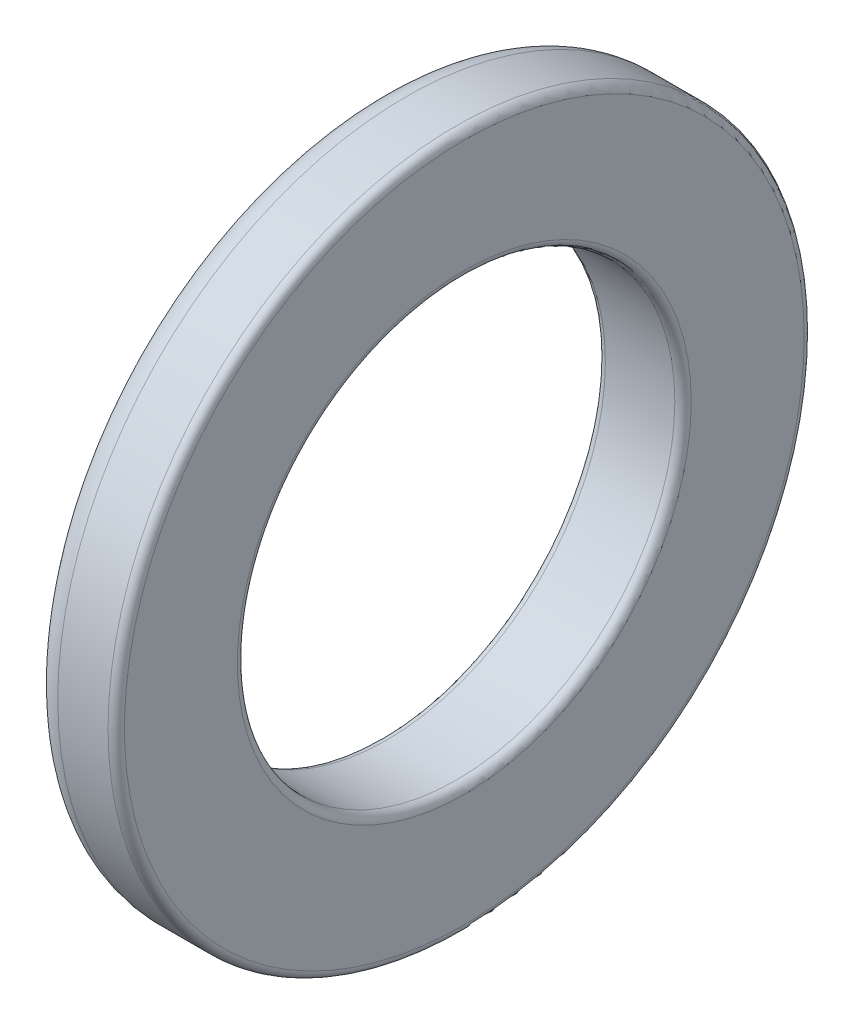
ISO-10303-21;
HEADER;
FILE_DESCRIPTION(('STEP AP214'),'2;1');
FILE_NAME('part.step','',(''),(''),'','','');
FILE_SCHEMA(('AUTOMOTIVE_DESIGN { 1 0 10303 214 1 1 1 1 }'));
ENDSEC;
DATA;
#1=APPLICATION_CONTEXT('core data for automotive mechanical design processes');
#2=APPLICATION_PROTOCOL_DEFINITION('international standard','automotive_design',2000,#1);
#3=PRODUCT_CONTEXT('',#1,'mechanical');
#4=PRODUCT('Part','Part','',(#3));
#5=PRODUCT_RELATED_PRODUCT_CATEGORY('part','',(#4));
#6=PRODUCT_DEFINITION_FORMATION('','',#4);
#7=PRODUCT_DEFINITION_CONTEXT('part definition',#1,'design');
#8=PRODUCT_DEFINITION('design','',#6,#7);
#9=PRODUCT_DEFINITION_SHAPE('','',#8);
#10=(LENGTH_UNIT() NAMED_UNIT(*) SI_UNIT(.MILLI.,.METRE.));
#11=(NAMED_UNIT(*) PLANE_ANGLE_UNIT() SI_UNIT($,.RADIAN.));
#12=(NAMED_UNIT(*) SI_UNIT($,.STERADIAN.) SOLID_ANGLE_UNIT());
#13=UNCERTAINTY_MEASURE_WITH_UNIT(LENGTH_MEASURE(1.E-05),#10,'distance_accuracy_value','');
#14=(GEOMETRIC_REPRESENTATION_CONTEXT(3) GLOBAL_UNCERTAINTY_ASSIGNED_CONTEXT((#13)) GLOBAL_UNIT_ASSIGNED_CONTEXT((#10,
#11,#12)) REPRESENTATION_CONTEXT('',''));
#15=CARTESIAN_POINT('',(0.,0.,0.));
#16=DIRECTION('',(0.,0.,1.));
#17=DIRECTION('',(1.,0.,0.));
#18=AXIS2_PLACEMENT_3D('',#15,#16,#17);
#19=CARTESIAN_POINT('',(1.57,0.,0.));
#20=DIRECTION('',(1.,0.,0.));
#21=DIRECTION('',(0.,0.,-1.));
#22=AXIS2_PLACEMENT_3D('',#19,#20,#21);
#23=PLANE('',#22);
#24=CARTESIAN_POINT('',(1.57,0.,0.));
#25=DIRECTION('',(1.,0.,0.));
#26=DIRECTION('',(0.,0.,-1.));
#27=AXIS2_PLACEMENT_3D('',#24,#25,#26);
#28=CIRCLE('',#27,4.15);
#29=CARTESIAN_POINT('',(1.57,0.,-4.15));
#30=VERTEX_POINT('',#29);
#31=EDGE_CURVE('E54',#30,#30,#28,.F.);
#32=ORIENTED_EDGE('',*,*,#31,.T.);
#33=EDGE_LOOP('',(#32));
#34=FACE_BOUND('',#33,.T.);
#35=CARTESIAN_POINT('',(1.57,0.,0.));
#36=DIRECTION('',(1.,0.,0.));
#37=DIRECTION('',(0.,0.,-1.));
#38=AXIS2_PLACEMENT_3D('',#35,#36,#37);
#39=CIRCLE('',#38,6.215);
#40=CARTESIAN_POINT('',(1.57,0.,-6.215));
#41=VERTEX_POINT('',#40);
#42=EDGE_CURVE('E57',#41,#41,#39,.T.);
#43=ORIENTED_EDGE('',*,*,#42,.T.);
#44=EDGE_LOOP('',(#43));
#45=FACE_BOUND('',#44,.T.);
#46=ADVANCED_FACE('F31',(#34,#45),#23,.T.);
#47=CARTESIAN_POINT('',(0.,0.,0.));
#48=DIRECTION('',(1.,0.,0.));
#49=DIRECTION('',(0.,0.,-1.));
#50=AXIS2_PLACEMENT_3D('',#47,#48,#49);
#51=PLANE('',#50);
#52=CARTESIAN_POINT('',(0.,0.,0.));
#53=DIRECTION('',(1.,0.,0.));
#54=DIRECTION('',(0.,0.,-1.));
#55=AXIS2_PLACEMENT_3D('',#52,#53,#54);
#56=CIRCLE('',#55,5.865);
#57=CARTESIAN_POINT('',(0.,0.,-5.865));
#58=VERTEX_POINT('',#57);
#59=EDGE_CURVE('E10',#58,#58,#56,.F.);
#60=ORIENTED_EDGE('',*,*,#59,.T.);
#61=EDGE_LOOP('',(#60));
#62=FACE_BOUND('',#61,.T.);
#63=CARTESIAN_POINT('',(0.,0.,0.));
#64=DIRECTION('',(1.,0.,0.));
#65=DIRECTION('',(0.,0.,-1.));
#66=AXIS2_PLACEMENT_3D('',#63,#64,#65);
#67=CIRCLE('',#66,4.15);
#68=CARTESIAN_POINT('',(0.,0.,-4.15));
#69=VERTEX_POINT('',#68);
#70=EDGE_CURVE('E46',#69,#69,#67,.T.);
#71=ORIENTED_EDGE('',*,*,#70,.T.);
#72=EDGE_LOOP('',(#71));
#73=FACE_BOUND('',#72,.T.);
#74=ADVANCED_FACE('F84',(#62,#73),#51,.F.);
#75=CARTESIAN_POINT('',(1.57,0.,0.));
#76=DIRECTION('',(-1.,0.,0.));
#77=DIRECTION('',(0.,0.,1.));
#78=AXIS2_PLACEMENT_3D('',#75,#76,#77);
#79=CYLINDRICAL_SURFACE('',#78,6.365);
#80=CARTESIAN_POINT('',(0.5,0.,0.));
#81=DIRECTION('',(1.,0.,0.));
#82=DIRECTION('',(0.,0.,-1.));
#83=AXIS2_PLACEMENT_3D('',#80,#81,#82);
#84=CIRCLE('',#83,6.365);
#85=CARTESIAN_POINT('',(0.5,0.,-6.365));
#86=VERTEX_POINT('',#85);
#87=EDGE_CURVE('E38',#86,#86,#84,.T.);
#88=ORIENTED_EDGE('',*,*,#87,.T.);
#89=EDGE_LOOP('',(#88));
#90=FACE_BOUND('',#89,.T.);
#91=CARTESIAN_POINT('',(1.42,0.,0.));
#92=DIRECTION('',(1.,0.,0.));
#93=DIRECTION('',(0.,0.,-1.));
#94=AXIS2_PLACEMENT_3D('',#91,#92,#93);
#95=CIRCLE('',#94,6.365);
#96=CARTESIAN_POINT('',(1.42,0.,-6.365));
#97=VERTEX_POINT('',#96);
#98=EDGE_CURVE('E51',#97,#97,#95,.F.);
#99=ORIENTED_EDGE('',*,*,#98,.T.);
#100=EDGE_LOOP('',(#99));
#101=FACE_BOUND('',#100,.T.);
#102=ADVANCED_FACE('F78',(#90,#101),#79,.T.);
#103=CARTESIAN_POINT('',(1.57,0.,0.));
#104=DIRECTION('',(-1.,0.,0.));
#105=DIRECTION('',(0.,0.,1.));
#106=AXIS2_PLACEMENT_3D('',#103,#104,#105);
#107=CYLINDRICAL_SURFACE('',#106,4.);
#108=CARTESIAN_POINT('',(0.15,0.,0.));
#109=DIRECTION('',(1.,0.,0.));
#110=DIRECTION('',(0.,0.,-1.));
#111=AXIS2_PLACEMENT_3D('',#108,#109,#110);
#112=CIRCLE('',#111,4.);
#113=CARTESIAN_POINT('',(0.15,0.,-4.));
#114=VERTEX_POINT('',#113);
#115=EDGE_CURVE('E42',#114,#114,#112,.F.);
#116=ORIENTED_EDGE('',*,*,#115,.T.);
#117=EDGE_LOOP('',(#116));
#118=FACE_BOUND('',#117,.T.);
#119=CARTESIAN_POINT('',(1.42,0.,0.));
#120=DIRECTION('',(1.,0.,0.));
#121=DIRECTION('',(0.,0.,-1.));
#122=AXIS2_PLACEMENT_3D('',#119,#120,#121);
#123=CIRCLE('',#122,4.);
#124=CARTESIAN_POINT('',(1.42,0.,-4.));
#125=VERTEX_POINT('',#124);
#126=EDGE_CURVE('E60',#125,#125,#123,.T.);
#127=ORIENTED_EDGE('',*,*,#126,.T.);
#128=EDGE_LOOP('',(#127));
#129=FACE_BOUND('',#128,.T.);
#130=ADVANCED_FACE('F64',(#118,#129),#107,.F.);
#131=CARTESIAN_POINT('',(1.42,0.,0.));
#132=DIRECTION('',(1.,0.,0.));
#133=DIRECTION('',(0.,0.,-1.));
#134=AXIS2_PLACEMENT_3D('',#131,#132,#133);
#135=TOROIDAL_SURFACE('',#134,4.15,0.15);
#136=ORIENTED_EDGE('',*,*,#31,.F.);
#137=EDGE_LOOP('',(#136));
#138=FACE_BOUND('',#137,.T.);
#139=ORIENTED_EDGE('',*,*,#126,.F.);
#140=EDGE_LOOP('',(#139));
#141=FACE_BOUND('',#140,.T.);
#142=ADVANCED_FACE('F66',(#138,#141),#135,.T.);
#143=CARTESIAN_POINT('',(1.42,0.,0.));
#144=DIRECTION('',(1.,0.,0.));
#145=DIRECTION('',(0.,0.,-1.));
#146=AXIS2_PLACEMENT_3D('',#143,#144,#145);
#147=TOROIDAL_SURFACE('',#146,6.215,0.15);
#148=ORIENTED_EDGE('',*,*,#98,.F.);
#149=EDGE_LOOP('',(#148));
#150=FACE_BOUND('',#149,.T.);
#151=ORIENTED_EDGE('',*,*,#42,.F.);
#152=EDGE_LOOP('',(#151));
#153=FACE_BOUND('',#152,.T.);
#154=ADVANCED_FACE('F68',(#150,#153),#147,.T.);
#155=CARTESIAN_POINT('',(0.15,0.,0.));
#156=DIRECTION('',(1.,0.,0.));
#157=DIRECTION('',(0.,0.,-1.));
#158=AXIS2_PLACEMENT_3D('',#155,#156,#157);
#159=TOROIDAL_SURFACE('',#158,4.15,0.15);
#160=ORIENTED_EDGE('',*,*,#115,.F.);
#161=EDGE_LOOP('',(#160));
#162=FACE_BOUND('',#161,.T.);
#163=ORIENTED_EDGE('',*,*,#70,.F.);
#164=EDGE_LOOP('',(#163));
#165=FACE_BOUND('',#164,.T.);
#166=ADVANCED_FACE('F75',(#162,#165),#159,.T.);
#167=CARTESIAN_POINT('',(0.5,0.,0.));
#168=DIRECTION('',(1.,0.,0.));
#169=DIRECTION('',(0.,0.,-1.));
#170=AXIS2_PLACEMENT_3D('',#167,#168,#169);
#171=TOROIDAL_SURFACE('',#170,5.865,0.5);
#172=ORIENTED_EDGE('',*,*,#59,.F.);
#173=EDGE_LOOP('',(#172));
#174=FACE_BOUND('',#173,.T.);
#175=ORIENTED_EDGE('',*,*,#87,.F.);
#176=EDGE_LOOP('',(#175));
#177=FACE_BOUND('',#176,.T.);
#178=ADVANCED_FACE('F33',(#174,#177),#171,.T.);
#179=CLOSED_SHELL('',(#46,#74,#102,#130,#142,#154,#166,#178));
#180=MANIFOLD_SOLID_BREP('B2',#179);
#181=ADVANCED_BREP_SHAPE_REPRESENTATION('',(#18,#180),#14);
#182=SHAPE_DEFINITION_REPRESENTATION(#9,#181);
ENDSEC;
END-ISO-10303-21;
